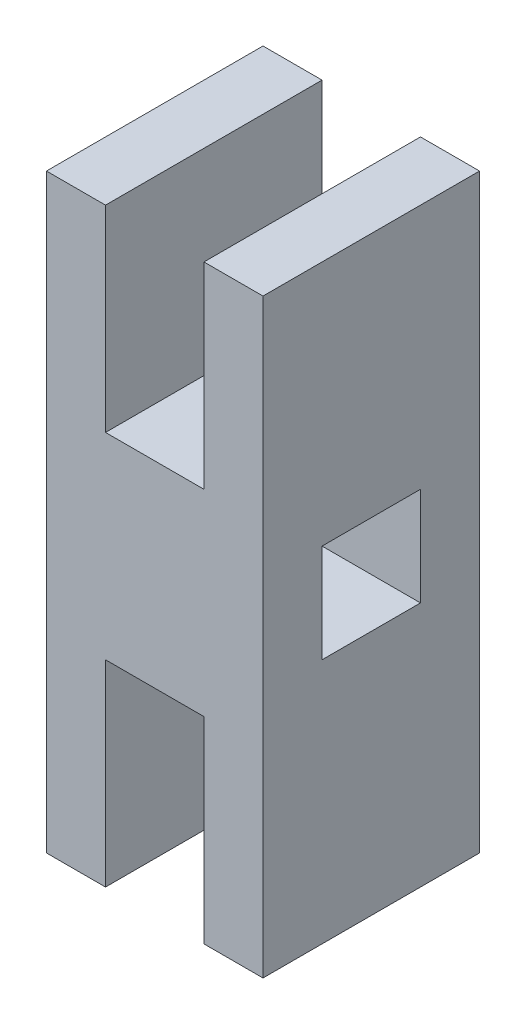
ISO-10303-21;
HEADER;
FILE_DESCRIPTION(('STEP AP214'),'2;1');
FILE_NAME('part.step','',(''),(''),'','','');
FILE_SCHEMA(('AUTOMOTIVE_DESIGN { 1 0 10303 214 1 1 1 1 }'));
ENDSEC;
DATA;
#1=APPLICATION_CONTEXT('core data for automotive mechanical design processes');
#2=APPLICATION_PROTOCOL_DEFINITION('international standard','automotive_design',2000,#1);
#3=PRODUCT_CONTEXT('',#1,'mechanical');
#4=PRODUCT('Part','Part','',(#3));
#5=PRODUCT_RELATED_PRODUCT_CATEGORY('part','',(#4));
#6=PRODUCT_DEFINITION_FORMATION('','',#4);
#7=PRODUCT_DEFINITION_CONTEXT('part definition',#1,'design');
#8=PRODUCT_DEFINITION('design','',#6,#7);
#9=PRODUCT_DEFINITION_SHAPE('','',#8);
#10=(LENGTH_UNIT() NAMED_UNIT(*) SI_UNIT(.MILLI.,.METRE.));
#11=(NAMED_UNIT(*) PLANE_ANGLE_UNIT() SI_UNIT($,.RADIAN.));
#12=(NAMED_UNIT(*) SI_UNIT($,.STERADIAN.) SOLID_ANGLE_UNIT());
#13=UNCERTAINTY_MEASURE_WITH_UNIT(LENGTH_MEASURE(1.E-05),#10,'distance_accuracy_value','');
#14=(GEOMETRIC_REPRESENTATION_CONTEXT(3) GLOBAL_UNCERTAINTY_ASSIGNED_CONTEXT((#13)) GLOBAL_UNIT_ASSIGNED_CONTEXT((#10,
#11,#12)) REPRESENTATION_CONTEXT('',''));
#15=CARTESIAN_POINT('',(0.,0.,0.));
#16=DIRECTION('',(0.,0.,1.));
#17=DIRECTION('',(1.,0.,0.));
#18=AXIS2_PLACEMENT_3D('',#15,#16,#17);
#19=CARTESIAN_POINT('',(-2.5,-5.,-1.));
#20=DIRECTION('',(1.,0.,0.));
#21=DIRECTION('',(0.,0.,-1.));
#22=AXIS2_PLACEMENT_3D('',#19,#20,#21);
#23=PLANE('',#22);
#24=DIRECTION('',(0.,0.,1.));
#25=VECTOR('',#24,1.);
#26=CARTESIAN_POINT('',(-2.5,-5.,-1.));
#27=LINE('',#26,#25);
#28=CARTESIAN_POINT('',(-2.5,-5.,-1.));
#29=VERTEX_POINT('',#28);
#30=CARTESIAN_POINT('',(-2.5,-5.,10.));
#31=VERTEX_POINT('',#30);
#32=EDGE_CURVE('E283',#29,#31,#27,.T.);
#33=ORIENTED_EDGE('',*,*,#32,.T.);
#34=DIRECTION('',(0.,1.,0.));
#35=VECTOR('',#34,1.);
#36=CARTESIAN_POINT('',(-2.5,-5.,10.));
#37=LINE('',#36,#35);
#38=CARTESIAN_POINT('',(-2.5,-15.,10.));
#39=VERTEX_POINT('',#38);
#40=EDGE_CURVE('E181',#39,#31,#37,.T.);
#41=ORIENTED_EDGE('',*,*,#40,.F.);
#42=DIRECTION('',(0.,0.,1.));
#43=VECTOR('',#42,1.);
#44=CARTESIAN_POINT('',(-2.5,-15.,-1.));
#45=LINE('',#44,#43);
#46=CARTESIAN_POINT('',(-2.5,-15.,-1.));
#47=VERTEX_POINT('',#46);
#48=EDGE_CURVE('E284',#47,#39,#45,.T.);
#49=ORIENTED_EDGE('',*,*,#48,.F.);
#50=DIRECTION('',(0.,1.,0.));
#51=VECTOR('',#50,1.);
#52=CARTESIAN_POINT('',(-2.5,-5.,-1.));
#53=LINE('',#52,#51);
#54=EDGE_CURVE('E235',#47,#29,#53,.T.);
#55=ORIENTED_EDGE('',*,*,#54,.T.);
#56=EDGE_LOOP('',(#33,#41,#49,#55));
#57=FACE_BOUND('',#56,.T.);
#58=ADVANCED_FACE('F39',(#57),#23,.T.);
#59=CARTESIAN_POINT('',(-2.5,-15.,-1.));
#60=DIRECTION('',(0.,-1.,0.));
#61=DIRECTION('',(0.,0.,-1.));
#62=AXIS2_PLACEMENT_3D('',#59,#60,#61);
#63=PLANE('',#62);
#64=ORIENTED_EDGE('',*,*,#48,.T.);
#65=DIRECTION('',(1.,0.,0.));
#66=VECTOR('',#65,1.);
#67=CARTESIAN_POINT('',(-2.5,-15.,10.));
#68=LINE('',#67,#66);
#69=CARTESIAN_POINT('',(-5.5,-15.,10.));
#70=VERTEX_POINT('',#69);
#71=EDGE_CURVE('E231',#70,#39,#68,.T.);
#72=ORIENTED_EDGE('',*,*,#71,.F.);
#73=DIRECTION('',(0.,0.,1.));
#74=VECTOR('',#73,1.);
#75=CARTESIAN_POINT('',(-5.5,-15.,-1.));
#76=LINE('',#75,#74);
#77=CARTESIAN_POINT('',(-5.5,-15.,-1.));
#78=VERTEX_POINT('',#77);
#79=EDGE_CURVE('E288',#78,#70,#76,.T.);
#80=ORIENTED_EDGE('',*,*,#79,.F.);
#81=DIRECTION('',(1.,0.,0.));
#82=VECTOR('',#81,1.);
#83=CARTESIAN_POINT('',(-2.5,-15.,-1.));
#84=LINE('',#83,#82);
#85=EDGE_CURVE('E279',#78,#47,#84,.T.);
#86=ORIENTED_EDGE('',*,*,#85,.T.);
#87=EDGE_LOOP('',(#64,#72,#80,#86));
#88=FACE_BOUND('',#87,.T.);
#89=ADVANCED_FACE('F342',(#88),#63,.T.);
#90=CARTESIAN_POINT('',(-5.5,15.,-1.));
#91=DIRECTION('',(-1.,0.,0.));
#92=DIRECTION('',(0.,0.,1.));
#93=AXIS2_PLACEMENT_3D('',#90,#91,#92);
#94=PLANE('',#93);
#95=DIRECTION('',(0.,1.,0.));
#96=VECTOR('',#95,1.);
#97=CARTESIAN_POINT('',(-5.5,2.5,2.));
#98=LINE('',#97,#96);
#99=CARTESIAN_POINT('',(-5.5,-2.5,2.));
#100=VERTEX_POINT('',#99);
#101=CARTESIAN_POINT('',(-5.5,2.5,2.));
#102=VERTEX_POINT('',#101);
#103=EDGE_CURVE('E154',#100,#102,#98,.T.);
#104=ORIENTED_EDGE('',*,*,#103,.T.);
#105=DIRECTION('',(0.,0.,1.));
#106=VECTOR('',#105,1.);
#107=CARTESIAN_POINT('',(-5.5,2.5,7.));
#108=LINE('',#107,#106);
#109=CARTESIAN_POINT('',(-5.5,2.5,7.));
#110=VERTEX_POINT('',#109);
#111=EDGE_CURVE('E163',#102,#110,#108,.T.);
#112=ORIENTED_EDGE('',*,*,#111,.T.);
#113=DIRECTION('',(0.,-1.,0.));
#114=VECTOR('',#113,1.);
#115=CARTESIAN_POINT('',(-5.5,2.5,7.));
#116=LINE('',#115,#114);
#117=CARTESIAN_POINT('',(-5.5,-2.5,7.));
#118=VERTEX_POINT('',#117);
#119=EDGE_CURVE('E54',#110,#118,#116,.T.);
#120=ORIENTED_EDGE('',*,*,#119,.T.);
#121=DIRECTION('',(0.,0.,-1.));
#122=VECTOR('',#121,1.);
#123=CARTESIAN_POINT('',(-5.5,-2.5,7.));
#124=LINE('',#123,#122);
#125=EDGE_CURVE('E160',#118,#100,#124,.T.);
#126=ORIENTED_EDGE('',*,*,#125,.T.);
#127=EDGE_LOOP('',(#104,#112,#120,#126));
#128=FACE_BOUND('',#127,.T.);
#129=ORIENTED_EDGE('',*,*,#79,.T.);
#130=DIRECTION('',(0.,-1.,0.));
#131=VECTOR('',#130,1.);
#132=CARTESIAN_POINT('',(-5.5,15.,10.));
#133=LINE('',#132,#131);
#134=CARTESIAN_POINT('',(-5.5,15.,10.));
#135=VERTEX_POINT('',#134);
#136=EDGE_CURVE('E227',#135,#70,#133,.T.);
#137=ORIENTED_EDGE('',*,*,#136,.F.);
#138=DIRECTION('',(0.,0.,1.));
#139=VECTOR('',#138,1.);
#140=CARTESIAN_POINT('',(-5.5,15.,-1.));
#141=LINE('',#140,#139);
#142=CARTESIAN_POINT('',(-5.5,15.,-1.));
#143=VERTEX_POINT('',#142);
#144=EDGE_CURVE('E291',#143,#135,#141,.T.);
#145=ORIENTED_EDGE('',*,*,#144,.F.);
#146=DIRECTION('',(0.,-1.,0.));
#147=VECTOR('',#146,1.);
#148=CARTESIAN_POINT('',(-5.5,15.,-1.));
#149=LINE('',#148,#147);
#150=EDGE_CURVE('E275',#143,#78,#149,.T.);
#151=ORIENTED_EDGE('',*,*,#150,.T.);
#152=EDGE_LOOP('',(#129,#137,#145,#151));
#153=FACE_BOUND('',#152,.T.);
#154=ADVANCED_FACE('F168',(#128,#153),#94,.T.);
#155=CARTESIAN_POINT('',(-2.5,15.,-1.));
#156=DIRECTION('',(0.,1.,0.));
#157=DIRECTION('',(0.,0.,1.));
#158=AXIS2_PLACEMENT_3D('',#155,#156,#157);
#159=PLANE('',#158);
#160=ORIENTED_EDGE('',*,*,#144,.T.);
#161=DIRECTION('',(-1.,0.,0.));
#162=VECTOR('',#161,1.);
#163=CARTESIAN_POINT('',(-2.5,15.,10.));
#164=LINE('',#163,#162);
#165=CARTESIAN_POINT('',(-2.5,15.,10.));
#166=VERTEX_POINT('',#165);
#167=EDGE_CURVE('E223',#166,#135,#164,.T.);
#168=ORIENTED_EDGE('',*,*,#167,.F.);
#169=DIRECTION('',(0.,0.,1.));
#170=VECTOR('',#169,1.);
#171=CARTESIAN_POINT('',(-2.5,15.,-1.));
#172=LINE('',#171,#170);
#173=CARTESIAN_POINT('',(-2.5,15.,-1.));
#174=VERTEX_POINT('',#173);
#175=EDGE_CURVE('E294',#174,#166,#172,.T.);
#176=ORIENTED_EDGE('',*,*,#175,.F.);
#177=DIRECTION('',(-1.,0.,0.));
#178=VECTOR('',#177,1.);
#179=CARTESIAN_POINT('',(-2.5,15.,-1.));
#180=LINE('',#179,#178);
#181=EDGE_CURVE('E271',#174,#143,#180,.T.);
#182=ORIENTED_EDGE('',*,*,#181,.T.);
#183=EDGE_LOOP('',(#160,#168,#176,#182));
#184=FACE_BOUND('',#183,.T.);
#185=ADVANCED_FACE('F392',(#184),#159,.T.);
#186=CARTESIAN_POINT('',(-2.5,5.,-1.));
#187=DIRECTION('',(1.,0.,0.));
#188=DIRECTION('',(0.,0.,-1.));
#189=AXIS2_PLACEMENT_3D('',#186,#187,#188);
#190=PLANE('',#189);
#191=ORIENTED_EDGE('',*,*,#175,.T.);
#192=DIRECTION('',(0.,1.,0.));
#193=VECTOR('',#192,1.);
#194=CARTESIAN_POINT('',(-2.5,5.,10.));
#195=LINE('',#194,#193);
#196=CARTESIAN_POINT('',(-2.5,5.,10.));
#197=VERTEX_POINT('',#196);
#198=EDGE_CURVE('E219',#197,#166,#195,.T.);
#199=ORIENTED_EDGE('',*,*,#198,.F.);
#200=DIRECTION('',(0.,0.,1.));
#201=VECTOR('',#200,1.);
#202=CARTESIAN_POINT('',(-2.5,5.,-1.));
#203=LINE('',#202,#201);
#204=CARTESIAN_POINT('',(-2.5,5.,-1.));
#205=VERTEX_POINT('',#204);
#206=EDGE_CURVE('E297',#205,#197,#203,.T.);
#207=ORIENTED_EDGE('',*,*,#206,.F.);
#208=DIRECTION('',(0.,1.,0.));
#209=VECTOR('',#208,1.);
#210=CARTESIAN_POINT('',(-2.5,5.,-1.));
#211=LINE('',#210,#209);
#212=EDGE_CURVE('E267',#205,#174,#211,.T.);
#213=ORIENTED_EDGE('',*,*,#212,.T.);
#214=EDGE_LOOP('',(#191,#199,#207,#213));
#215=FACE_BOUND('',#214,.T.);
#216=ADVANCED_FACE('F388',(#215),#190,.T.);
#217=CARTESIAN_POINT('',(-2.5,5.,-1.));
#218=DIRECTION('',(0.,1.,0.));
#219=DIRECTION('',(0.,0.,1.));
#220=AXIS2_PLACEMENT_3D('',#217,#218,#219);
#221=PLANE('',#220);
#222=ORIENTED_EDGE('',*,*,#206,.T.);
#223=DIRECTION('',(-1.,0.,0.));
#224=VECTOR('',#223,1.);
#225=CARTESIAN_POINT('',(-2.5,5.,10.));
#226=LINE('',#225,#224);
#227=CARTESIAN_POINT('',(2.5,5.,10.));
#228=VERTEX_POINT('',#227);
#229=EDGE_CURVE('E215',#228,#197,#226,.T.);
#230=ORIENTED_EDGE('',*,*,#229,.F.);
#231=DIRECTION('',(0.,0.,1.));
#232=VECTOR('',#231,1.);
#233=CARTESIAN_POINT('',(2.5,5.,-1.));
#234=LINE('',#233,#232);
#235=CARTESIAN_POINT('',(2.5,5.,-1.));
#236=VERTEX_POINT('',#235);
#237=EDGE_CURVE('E300',#236,#228,#234,.T.);
#238=ORIENTED_EDGE('',*,*,#237,.F.);
#239=DIRECTION('',(-1.,0.,0.));
#240=VECTOR('',#239,1.);
#241=CARTESIAN_POINT('',(-2.5,5.,-1.));
#242=LINE('',#241,#240);
#243=EDGE_CURVE('E263',#236,#205,#242,.T.);
#244=ORIENTED_EDGE('',*,*,#243,.T.);
#245=EDGE_LOOP('',(#222,#230,#238,#244));
#246=FACE_BOUND('',#245,.T.);
#247=ADVANCED_FACE('F384',(#246),#221,.T.);
#248=CARTESIAN_POINT('',(2.5,5.,-1.));
#249=DIRECTION('',(-1.,0.,0.));
#250=DIRECTION('',(0.,0.,1.));
#251=AXIS2_PLACEMENT_3D('',#248,#249,#250);
#252=PLANE('',#251);
#253=ORIENTED_EDGE('',*,*,#237,.T.);
#254=DIRECTION('',(0.,-1.,0.));
#255=VECTOR('',#254,1.);
#256=CARTESIAN_POINT('',(2.5,5.,10.));
#257=LINE('',#256,#255);
#258=CARTESIAN_POINT('',(2.5,15.,10.));
#259=VERTEX_POINT('',#258);
#260=EDGE_CURVE('E211',#259,#228,#257,.T.);
#261=ORIENTED_EDGE('',*,*,#260,.F.);
#262=DIRECTION('',(0.,0.,1.));
#263=VECTOR('',#262,1.);
#264=CARTESIAN_POINT('',(2.5,15.,-1.));
#265=LINE('',#264,#263);
#266=CARTESIAN_POINT('',(2.5,15.,-1.));
#267=VERTEX_POINT('',#266);
#268=EDGE_CURVE('E303',#267,#259,#265,.T.);
#269=ORIENTED_EDGE('',*,*,#268,.F.);
#270=DIRECTION('',(0.,-1.,0.));
#271=VECTOR('',#270,1.);
#272=CARTESIAN_POINT('',(2.5,5.,-1.));
#273=LINE('',#272,#271);
#274=EDGE_CURVE('E259',#267,#236,#273,.T.);
#275=ORIENTED_EDGE('',*,*,#274,.T.);
#276=EDGE_LOOP('',(#253,#261,#269,#275));
#277=FACE_BOUND('',#276,.T.);
#278=ADVANCED_FACE('F382',(#277),#252,.T.);
#279=CARTESIAN_POINT('',(2.5,15.,-1.));
#280=DIRECTION('',(0.,1.,0.));
#281=DIRECTION('',(0.,0.,1.));
#282=AXIS2_PLACEMENT_3D('',#279,#280,#281);
#283=PLANE('',#282);
#284=ORIENTED_EDGE('',*,*,#268,.T.);
#285=DIRECTION('',(-1.,0.,0.));
#286=VECTOR('',#285,1.);
#287=CARTESIAN_POINT('',(2.5,15.,10.));
#288=LINE('',#287,#286);
#289=CARTESIAN_POINT('',(5.5,15.,10.));
#290=VERTEX_POINT('',#289);
#291=EDGE_CURVE('E207',#290,#259,#288,.T.);
#292=ORIENTED_EDGE('',*,*,#291,.F.);
#293=DIRECTION('',(0.,0.,1.));
#294=VECTOR('',#293,1.);
#295=CARTESIAN_POINT('',(5.5,15.,-1.));
#296=LINE('',#295,#294);
#297=CARTESIAN_POINT('',(5.5,15.,-1.));
#298=VERTEX_POINT('',#297);
#299=EDGE_CURVE('E306',#298,#290,#296,.T.);
#300=ORIENTED_EDGE('',*,*,#299,.F.);
#301=DIRECTION('',(-1.,0.,0.));
#302=VECTOR('',#301,1.);
#303=CARTESIAN_POINT('',(2.5,15.,-1.));
#304=LINE('',#303,#302);
#305=EDGE_CURVE('E255',#298,#267,#304,.T.);
#306=ORIENTED_EDGE('',*,*,#305,.T.);
#307=EDGE_LOOP('',(#284,#292,#300,#306));
#308=FACE_BOUND('',#307,.T.);
#309=ADVANCED_FACE('F377',(#308),#283,.T.);
#310=CARTESIAN_POINT('',(5.5,15.,-1.));
#311=DIRECTION('',(1.,0.,0.));
#312=DIRECTION('',(0.,0.,-1.));
#313=AXIS2_PLACEMENT_3D('',#310,#311,#312);
#314=PLANE('',#313);
#315=DIRECTION('',(0.,1.,0.));
#316=VECTOR('',#315,1.);
#317=CARTESIAN_POINT('',(5.5,15.,2.00000000000001));
#318=LINE('',#317,#316);
#319=CARTESIAN_POINT('',(5.5,-2.5,2.));
#320=VERTEX_POINT('',#319);
#321=CARTESIAN_POINT('',(5.5,2.5,2.));
#322=VERTEX_POINT('',#321);
#323=EDGE_CURVE('E11',#320,#322,#318,.T.);
#324=ORIENTED_EDGE('',*,*,#323,.F.);
#325=DIRECTION('',(0.,0.,-1.));
#326=VECTOR('',#325,1.);
#327=CARTESIAN_POINT('',(5.5,-2.5,-1.));
#328=LINE('',#327,#326);
#329=CARTESIAN_POINT('',(5.5,-2.5,7.));
#330=VERTEX_POINT('',#329);
#331=EDGE_CURVE('E47',#330,#320,#328,.T.);
#332=ORIENTED_EDGE('',*,*,#331,.F.);
#333=DIRECTION('',(0.,-1.,0.));
#334=VECTOR('',#333,1.);
#335=CARTESIAN_POINT('',(5.5,15.,7.));
#336=LINE('',#335,#334);
#337=CARTESIAN_POINT('',(5.5,2.5,7.));
#338=VERTEX_POINT('',#337);
#339=EDGE_CURVE('E322',#338,#330,#336,.T.);
#340=ORIENTED_EDGE('',*,*,#339,.F.);
#341=DIRECTION('',(0.,0.,1.));
#342=VECTOR('',#341,1.);
#343=CARTESIAN_POINT('',(5.5,2.5,-1.));
#344=LINE('',#343,#342);
#345=EDGE_CURVE('E287',#322,#338,#344,.T.);
#346=ORIENTED_EDGE('',*,*,#345,.F.);
#347=EDGE_LOOP('',(#324,#332,#340,#346));
#348=FACE_BOUND('',#347,.T.);
#349=ORIENTED_EDGE('',*,*,#299,.T.);
#350=DIRECTION('',(0.,1.,0.));
#351=VECTOR('',#350,1.);
#352=CARTESIAN_POINT('',(5.5,15.,10.));
#353=LINE('',#352,#351);
#354=CARTESIAN_POINT('',(5.5,-15.,10.));
#355=VERTEX_POINT('',#354);
#356=EDGE_CURVE('E203',#355,#290,#353,.T.);
#357=ORIENTED_EDGE('',*,*,#356,.F.);
#358=DIRECTION('',(0.,0.,1.));
#359=VECTOR('',#358,1.);
#360=CARTESIAN_POINT('',(5.5,-15.,-1.));
#361=LINE('',#360,#359);
#362=CARTESIAN_POINT('',(5.5,-15.,-1.));
#363=VERTEX_POINT('',#362);
#364=EDGE_CURVE('E309',#363,#355,#361,.T.);
#365=ORIENTED_EDGE('',*,*,#364,.F.);
#366=DIRECTION('',(0.,1.,0.));
#367=VECTOR('',#366,1.);
#368=CARTESIAN_POINT('',(5.5,15.,-1.));
#369=LINE('',#368,#367);
#370=EDGE_CURVE('E251',#363,#298,#369,.T.);
#371=ORIENTED_EDGE('',*,*,#370,.T.);
#372=EDGE_LOOP('',(#349,#357,#365,#371));
#373=FACE_BOUND('',#372,.T.);
#374=ADVANCED_FACE('F330',(#348,#373),#314,.T.);
#375=CARTESIAN_POINT('',(2.5,-15.,-1.));
#376=DIRECTION('',(0.,-1.,0.));
#377=DIRECTION('',(0.,0.,-1.));
#378=AXIS2_PLACEMENT_3D('',#375,#376,#377);
#379=PLANE('',#378);
#380=ORIENTED_EDGE('',*,*,#364,.T.);
#381=DIRECTION('',(1.,0.,0.));
#382=VECTOR('',#381,1.);
#383=CARTESIAN_POINT('',(2.5,-15.,10.));
#384=LINE('',#383,#382);
#385=CARTESIAN_POINT('',(2.5,-15.,10.));
#386=VERTEX_POINT('',#385);
#387=EDGE_CURVE('E199',#386,#355,#384,.T.);
#388=ORIENTED_EDGE('',*,*,#387,.F.);
#389=DIRECTION('',(0.,0.,1.));
#390=VECTOR('',#389,1.);
#391=CARTESIAN_POINT('',(2.5,-15.,-1.));
#392=LINE('',#391,#390);
#393=CARTESIAN_POINT('',(2.5,-15.,-1.));
#394=VERTEX_POINT('',#393);
#395=EDGE_CURVE('E312',#394,#386,#392,.T.);
#396=ORIENTED_EDGE('',*,*,#395,.F.);
#397=DIRECTION('',(1.,0.,0.));
#398=VECTOR('',#397,1.);
#399=CARTESIAN_POINT('',(2.5,-15.,-1.));
#400=LINE('',#399,#398);
#401=EDGE_CURVE('E247',#394,#363,#400,.T.);
#402=ORIENTED_EDGE('',*,*,#401,.T.);
#403=EDGE_LOOP('',(#380,#388,#396,#402));
#404=FACE_BOUND('',#403,.T.);
#405=ADVANCED_FACE('F372',(#404),#379,.T.);
#406=CARTESIAN_POINT('',(2.5,-5.,-1.));
#407=DIRECTION('',(-1.,0.,0.));
#408=DIRECTION('',(0.,0.,1.));
#409=AXIS2_PLACEMENT_3D('',#406,#407,#408);
#410=PLANE('',#409);
#411=ORIENTED_EDGE('',*,*,#395,.T.);
#412=DIRECTION('',(0.,-1.,0.));
#413=VECTOR('',#412,1.);
#414=CARTESIAN_POINT('',(2.5,-5.,10.));
#415=LINE('',#414,#413);
#416=CARTESIAN_POINT('',(2.5,-5.,10.));
#417=VERTEX_POINT('',#416);
#418=EDGE_CURVE('E195',#417,#386,#415,.T.);
#419=ORIENTED_EDGE('',*,*,#418,.F.);
#420=DIRECTION('',(0.,0.,1.));
#421=VECTOR('',#420,1.);
#422=CARTESIAN_POINT('',(2.5,-5.,-1.));
#423=LINE('',#422,#421);
#424=CARTESIAN_POINT('',(2.5,-5.,-1.));
#425=VERTEX_POINT('',#424);
#426=EDGE_CURVE('E315',#425,#417,#423,.T.);
#427=ORIENTED_EDGE('',*,*,#426,.F.);
#428=DIRECTION('',(0.,-1.,0.));
#429=VECTOR('',#428,1.);
#430=CARTESIAN_POINT('',(2.5,-5.,-1.));
#431=LINE('',#430,#429);
#432=EDGE_CURVE('E243',#425,#394,#431,.T.);
#433=ORIENTED_EDGE('',*,*,#432,.T.);
#434=EDGE_LOOP('',(#411,#419,#427,#433));
#435=FACE_BOUND('',#434,.T.);
#436=ADVANCED_FACE('F368',(#435),#410,.T.);
#437=CARTESIAN_POINT('',(-2.5,-5.,-1.));
#438=DIRECTION('',(0.,-1.,0.));
#439=DIRECTION('',(0.,0.,-1.));
#440=AXIS2_PLACEMENT_3D('',#437,#438,#439);
#441=PLANE('',#440);
#442=ORIENTED_EDGE('',*,*,#426,.T.);
#443=DIRECTION('',(1.,0.,0.));
#444=VECTOR('',#443,1.);
#445=CARTESIAN_POINT('',(-2.5,-5.,10.));
#446=LINE('',#445,#444);
#447=EDGE_CURVE('E191',#31,#417,#446,.T.);
#448=ORIENTED_EDGE('',*,*,#447,.F.);
#449=ORIENTED_EDGE('',*,*,#32,.F.);
#450=DIRECTION('',(1.,0.,0.));
#451=VECTOR('',#450,1.);
#452=CARTESIAN_POINT('',(-2.5,-5.,-1.));
#453=LINE('',#452,#451);
#454=EDGE_CURVE('E239',#29,#425,#453,.T.);
#455=ORIENTED_EDGE('',*,*,#454,.T.);
#456=EDGE_LOOP('',(#442,#448,#449,#455));
#457=FACE_BOUND('',#456,.T.);
#458=ADVANCED_FACE('F354',(#457),#441,.T.);
#459=CARTESIAN_POINT('',(0.,0.,-1.));
#460=DIRECTION('',(0.,0.,-1.));
#461=DIRECTION('',(-1.,0.,0.));
#462=AXIS2_PLACEMENT_3D('',#459,#460,#461);
#463=PLANE('',#462);
#464=ORIENTED_EDGE('',*,*,#54,.F.);
#465=ORIENTED_EDGE('',*,*,#85,.F.);
#466=ORIENTED_EDGE('',*,*,#150,.F.);
#467=ORIENTED_EDGE('',*,*,#181,.F.);
#468=ORIENTED_EDGE('',*,*,#212,.F.);
#469=ORIENTED_EDGE('',*,*,#243,.F.);
#470=ORIENTED_EDGE('',*,*,#274,.F.);
#471=ORIENTED_EDGE('',*,*,#305,.F.);
#472=ORIENTED_EDGE('',*,*,#370,.F.);
#473=ORIENTED_EDGE('',*,*,#401,.F.);
#474=ORIENTED_EDGE('',*,*,#432,.F.);
#475=ORIENTED_EDGE('',*,*,#454,.F.);
#476=EDGE_LOOP('',(#464,#465,#466,#467,#468,#469,#470,#471,#472,#473,#474,#475));
#477=FACE_BOUND('',#476,.T.);
#478=ADVANCED_FACE('F362',(#477),#463,.T.);
#479=CARTESIAN_POINT('',(0.,0.,10.));
#480=DIRECTION('',(0.,0.,-1.));
#481=DIRECTION('',(-1.,0.,0.));
#482=AXIS2_PLACEMENT_3D('',#479,#480,#481);
#483=PLANE('',#482);
#484=ORIENTED_EDGE('',*,*,#40,.T.);
#485=ORIENTED_EDGE('',*,*,#447,.T.);
#486=ORIENTED_EDGE('',*,*,#418,.T.);
#487=ORIENTED_EDGE('',*,*,#387,.T.);
#488=ORIENTED_EDGE('',*,*,#356,.T.);
#489=ORIENTED_EDGE('',*,*,#291,.T.);
#490=ORIENTED_EDGE('',*,*,#260,.T.);
#491=ORIENTED_EDGE('',*,*,#229,.T.);
#492=ORIENTED_EDGE('',*,*,#198,.T.);
#493=ORIENTED_EDGE('',*,*,#167,.T.);
#494=ORIENTED_EDGE('',*,*,#136,.T.);
#495=ORIENTED_EDGE('',*,*,#71,.T.);
#496=EDGE_LOOP('',(#484,#485,#486,#487,#488,#489,#490,#491,#492,#493,#494,#495));
#497=FACE_BOUND('',#496,.T.);
#498=ADVANCED_FACE('F357',(#497),#483,.F.);
#499=CARTESIAN_POINT('',(-5.5,2.5,2.));
#500=DIRECTION('',(0.,0.,-1.));
#501=DIRECTION('',(0.,1.,0.));
#502=AXIS2_PLACEMENT_3D('',#499,#500,#501);
#503=PLANE('',#502);
#504=ORIENTED_EDGE('',*,*,#323,.T.);
#505=DIRECTION('',(1.,0.,0.));
#506=VECTOR('',#505,1.);
#507=CARTESIAN_POINT('',(-5.5,2.5,2.));
#508=LINE('',#507,#506);
#509=EDGE_CURVE('E62',#102,#322,#508,.T.);
#510=ORIENTED_EDGE('',*,*,#509,.F.);
#511=ORIENTED_EDGE('',*,*,#103,.F.);
#512=DIRECTION('',(1.,0.,0.));
#513=VECTOR('',#512,1.);
#514=CARTESIAN_POINT('',(-5.5,-2.5,2.));
#515=LINE('',#514,#513);
#516=EDGE_CURVE('E178',#100,#320,#515,.T.);
#517=ORIENTED_EDGE('',*,*,#516,.T.);
#518=EDGE_LOOP('',(#504,#510,#511,#517));
#519=FACE_BOUND('',#518,.T.);
#520=ADVANCED_FACE('F151',(#519),#503,.F.);
#521=CARTESIAN_POINT('',(-5.5,-2.5,7.));
#522=DIRECTION('',(0.,-1.,0.));
#523=DIRECTION('',(0.,0.,-1.));
#524=AXIS2_PLACEMENT_3D('',#521,#522,#523);
#525=PLANE('',#524);
#526=ORIENTED_EDGE('',*,*,#331,.T.);
#527=ORIENTED_EDGE('',*,*,#516,.F.);
#528=ORIENTED_EDGE('',*,*,#125,.F.);
#529=DIRECTION('',(1.,0.,0.));
#530=VECTOR('',#529,1.);
#531=CARTESIAN_POINT('',(-5.5,-2.5,7.));
#532=LINE('',#531,#530);
#533=EDGE_CURVE('E182',#118,#330,#532,.T.);
#534=ORIENTED_EDGE('',*,*,#533,.T.);
#535=EDGE_LOOP('',(#526,#527,#528,#534));
#536=FACE_BOUND('',#535,.T.);
#537=ADVANCED_FACE('F327',(#536),#525,.F.);
#538=CARTESIAN_POINT('',(-5.5,2.5,7.));
#539=DIRECTION('',(0.,0.,1.));
#540=DIRECTION('',(1.,0.,0.));
#541=AXIS2_PLACEMENT_3D('',#538,#539,#540);
#542=PLANE('',#541);
#543=ORIENTED_EDGE('',*,*,#339,.T.);
#544=ORIENTED_EDGE('',*,*,#533,.F.);
#545=ORIENTED_EDGE('',*,*,#119,.F.);
#546=DIRECTION('',(1.,0.,0.));
#547=VECTOR('',#546,1.);
#548=CARTESIAN_POINT('',(-5.5,2.5,7.));
#549=LINE('',#548,#547);
#550=EDGE_CURVE('E159',#110,#338,#549,.T.);
#551=ORIENTED_EDGE('',*,*,#550,.T.);
#552=EDGE_LOOP('',(#543,#544,#545,#551));
#553=FACE_BOUND('',#552,.T.);
#554=ADVANCED_FACE('F332',(#553),#542,.F.);
#555=CARTESIAN_POINT('',(-5.5,2.5,7.));
#556=DIRECTION('',(0.,1.,0.));
#557=DIRECTION('',(0.,0.,1.));
#558=AXIS2_PLACEMENT_3D('',#555,#556,#557);
#559=PLANE('',#558);
#560=ORIENTED_EDGE('',*,*,#345,.T.);
#561=ORIENTED_EDGE('',*,*,#550,.F.);
#562=ORIENTED_EDGE('',*,*,#111,.F.);
#563=ORIENTED_EDGE('',*,*,#509,.T.);
#564=EDGE_LOOP('',(#560,#561,#562,#563));
#565=FACE_BOUND('',#564,.T.);
#566=ADVANCED_FACE('F164',(#565),#559,.F.);
#567=CLOSED_SHELL('',(#58,#89,#154,#185,#216,#247,#278,#309,#374,#405,#436,#458,#478,#498,#520,
#537,#554,#566));
#568=MANIFOLD_SOLID_BREP('B2',#567);
#569=ADVANCED_BREP_SHAPE_REPRESENTATION('',(#18,#568),#14);
#570=SHAPE_DEFINITION_REPRESENTATION(#9,#569);
ENDSEC;
END-ISO-10303-21;
